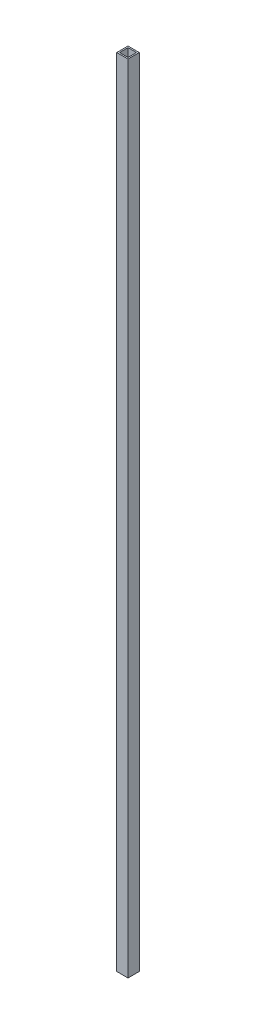
ISO-10303-21;
HEADER;
FILE_DESCRIPTION(('STEP AP214'),'2;1');
FILE_NAME('part.step','',(''),(''),'','','');
FILE_SCHEMA(('AUTOMOTIVE_DESIGN { 1 0 10303 214 1 1 1 1 }'));
ENDSEC;
DATA;
#1=APPLICATION_CONTEXT('core data for automotive mechanical design processes');
#2=APPLICATION_PROTOCOL_DEFINITION('international standard','automotive_design',2000,#1);
#3=PRODUCT_CONTEXT('',#1,'mechanical');
#4=PRODUCT('Part','Part','',(#3));
#5=PRODUCT_RELATED_PRODUCT_CATEGORY('part','',(#4));
#6=PRODUCT_DEFINITION_FORMATION('','',#4);
#7=PRODUCT_DEFINITION_CONTEXT('part definition',#1,'design');
#8=PRODUCT_DEFINITION('design','',#6,#7);
#9=PRODUCT_DEFINITION_SHAPE('','',#8);
#10=(LENGTH_UNIT() NAMED_UNIT(*) SI_UNIT(.MILLI.,.METRE.));
#11=(NAMED_UNIT(*) PLANE_ANGLE_UNIT() SI_UNIT($,.RADIAN.));
#12=(NAMED_UNIT(*) SI_UNIT($,.STERADIAN.) SOLID_ANGLE_UNIT());
#13=UNCERTAINTY_MEASURE_WITH_UNIT(LENGTH_MEASURE(1.E-05),#10,'distance_accuracy_value','');
#14=(GEOMETRIC_REPRESENTATION_CONTEXT(3) GLOBAL_UNCERTAINTY_ASSIGNED_CONTEXT((#13)) GLOBAL_UNIT_ASSIGNED_CONTEXT((#10,
#11,#12)) REPRESENTATION_CONTEXT('',''));
#15=CARTESIAN_POINT('',(0.,0.,0.));
#16=DIRECTION('',(0.,0.,1.));
#17=DIRECTION('',(1.,0.,0.));
#18=AXIS2_PLACEMENT_3D('',#15,#16,#17);
#19=CARTESIAN_POINT('',(0.,1408.5,0.));
#20=DIRECTION('',(0.,1.,0.));
#21=DIRECTION('',(0.,0.,1.));
#22=AXIS2_PLACEMENT_3D('',#19,#20,#21);
#23=PLANE('',#22);
#24=DIRECTION('',(0.,0.,1.));
#25=VECTOR('',#24,1.);
#26=CARTESIAN_POINT('',(-20.,1408.5,20.));
#27=LINE('',#26,#25);
#28=CARTESIAN_POINT('',(-20.,1408.5,-20.));
#29=VERTEX_POINT('',#28);
#30=CARTESIAN_POINT('',(-20.,1408.5,20.));
#31=VERTEX_POINT('',#30);
#32=EDGE_CURVE('E133',#29,#31,#27,.T.);
#33=ORIENTED_EDGE('',*,*,#32,.T.);
#34=DIRECTION('',(1.,0.,0.));
#35=VECTOR('',#34,1.);
#36=CARTESIAN_POINT('',(20.,1408.5,20.));
#37=LINE('',#36,#35);
#38=CARTESIAN_POINT('',(20.,1408.5,20.));
#39=VERTEX_POINT('',#38);
#40=EDGE_CURVE('E136',#31,#39,#37,.T.);
#41=ORIENTED_EDGE('',*,*,#40,.T.);
#42=DIRECTION('',(0.,0.,-1.));
#43=VECTOR('',#42,1.);
#44=CARTESIAN_POINT('',(20.,1408.5,20.));
#45=LINE('',#44,#43);
#46=CARTESIAN_POINT('',(20.,1408.5,-20.));
#47=VERTEX_POINT('',#46);
#48=EDGE_CURVE('E139',#39,#47,#45,.T.);
#49=ORIENTED_EDGE('',*,*,#48,.T.);
#50=DIRECTION('',(-1.,0.,0.));
#51=VECTOR('',#50,1.);
#52=CARTESIAN_POINT('',(20.,1408.5,-20.));
#53=LINE('',#52,#51);
#54=EDGE_CURVE('E141',#47,#29,#53,.T.);
#55=ORIENTED_EDGE('',*,*,#54,.T.);
#56=EDGE_LOOP('',(#33,#41,#49,#55));
#57=FACE_BOUND('',#56,.T.);
#58=DIRECTION('',(-1.,0.,0.));
#59=VECTOR('',#58,1.);
#60=CARTESIAN_POINT('',(15.,1408.5,-15.));
#61=LINE('',#60,#59);
#62=CARTESIAN_POINT('',(15.,1408.5,-15.));
#63=VERTEX_POINT('',#62);
#64=CARTESIAN_POINT('',(-15.,1408.5,-15.));
#65=VERTEX_POINT('',#64);
#66=EDGE_CURVE('E105',#63,#65,#61,.T.);
#67=ORIENTED_EDGE('',*,*,#66,.F.);
#68=DIRECTION('',(0.,0.,-1.));
#69=VECTOR('',#68,1.);
#70=CARTESIAN_POINT('',(15.,1408.5,15.));
#71=LINE('',#70,#69);
#72=CARTESIAN_POINT('',(15.,1408.5,15.));
#73=VERTEX_POINT('',#72);
#74=EDGE_CURVE('E97',#73,#63,#71,.T.);
#75=ORIENTED_EDGE('',*,*,#74,.F.);
#76=DIRECTION('',(1.,0.,0.));
#77=VECTOR('',#76,1.);
#78=CARTESIAN_POINT('',(15.,1408.5,15.));
#79=LINE('',#78,#77);
#80=CARTESIAN_POINT('',(-15.,1408.5,15.));
#81=VERTEX_POINT('',#80);
#82=EDGE_CURVE('E119',#81,#73,#79,.T.);
#83=ORIENTED_EDGE('',*,*,#82,.F.);
#84=DIRECTION('',(0.,0.,1.));
#85=VECTOR('',#84,1.);
#86=CARTESIAN_POINT('',(-15.,1408.5,15.));
#87=LINE('',#86,#85);
#88=EDGE_CURVE('E117',#65,#81,#87,.T.);
#89=ORIENTED_EDGE('',*,*,#88,.F.);
#90=EDGE_LOOP('',(#67,#75,#83,#89));
#91=FACE_BOUND('',#90,.T.);
#92=ADVANCED_FACE('F32',(#57,#91),#23,.T.);
#93=CARTESIAN_POINT('',(0.,-1408.5,0.));
#94=DIRECTION('',(0.,1.,0.));
#95=DIRECTION('',(0.,0.,1.));
#96=AXIS2_PLACEMENT_3D('',#93,#94,#95);
#97=PLANE('',#96);
#98=DIRECTION('',(0.,0.,1.));
#99=VECTOR('',#98,1.);
#100=CARTESIAN_POINT('',(-20.,-1408.5,20.));
#101=LINE('',#100,#99);
#102=CARTESIAN_POINT('',(-20.,-1408.5,-20.));
#103=VERTEX_POINT('',#102);
#104=CARTESIAN_POINT('',(-20.,-1408.5,20.));
#105=VERTEX_POINT('',#104);
#106=EDGE_CURVE('E113',#103,#105,#101,.T.);
#107=ORIENTED_EDGE('',*,*,#106,.F.);
#108=DIRECTION('',(-1.,0.,0.));
#109=VECTOR('',#108,1.);
#110=CARTESIAN_POINT('',(20.,-1408.5,-20.));
#111=LINE('',#110,#109);
#112=CARTESIAN_POINT('',(20.,-1408.5,-20.));
#113=VERTEX_POINT('',#112);
#114=EDGE_CURVE('E137',#113,#103,#111,.T.);
#115=ORIENTED_EDGE('',*,*,#114,.F.);
#116=DIRECTION('',(0.,0.,-1.));
#117=VECTOR('',#116,1.);
#118=CARTESIAN_POINT('',(20.,-1408.5,20.));
#119=LINE('',#118,#117);
#120=CARTESIAN_POINT('',(20.,-1408.5,20.));
#121=VERTEX_POINT('',#120);
#122=EDGE_CURVE('E148',#121,#113,#119,.T.);
#123=ORIENTED_EDGE('',*,*,#122,.F.);
#124=DIRECTION('',(1.,0.,0.));
#125=VECTOR('',#124,1.);
#126=CARTESIAN_POINT('',(20.,-1408.5,20.));
#127=LINE('',#126,#125);
#128=EDGE_CURVE('E146',#105,#121,#127,.T.);
#129=ORIENTED_EDGE('',*,*,#128,.F.);
#130=EDGE_LOOP('',(#107,#115,#123,#129));
#131=FACE_BOUND('',#130,.T.);
#132=DIRECTION('',(0.,0.,-1.));
#133=VECTOR('',#132,1.);
#134=CARTESIAN_POINT('',(15.,-1408.5,15.));
#135=LINE('',#134,#133);
#136=CARTESIAN_POINT('',(15.,-1408.5,15.));
#137=VERTEX_POINT('',#136);
#138=CARTESIAN_POINT('',(15.,-1408.5,-15.));
#139=VERTEX_POINT('',#138);
#140=EDGE_CURVE('E55',#137,#139,#135,.T.);
#141=ORIENTED_EDGE('',*,*,#140,.T.);
#142=DIRECTION('',(-1.,0.,0.));
#143=VECTOR('',#142,1.);
#144=CARTESIAN_POINT('',(15.,-1408.5,-15.));
#145=LINE('',#144,#143);
#146=CARTESIAN_POINT('',(-15.,-1408.5,-15.));
#147=VERTEX_POINT('',#146);
#148=EDGE_CURVE('E112',#139,#147,#145,.T.);
#149=ORIENTED_EDGE('',*,*,#148,.T.);
#150=DIRECTION('',(0.,0.,1.));
#151=VECTOR('',#150,1.);
#152=CARTESIAN_POINT('',(-15.,-1408.5,15.));
#153=LINE('',#152,#151);
#154=CARTESIAN_POINT('',(-15.,-1408.5,15.));
#155=VERTEX_POINT('',#154);
#156=EDGE_CURVE('E125',#147,#155,#153,.T.);
#157=ORIENTED_EDGE('',*,*,#156,.T.);
#158=DIRECTION('',(1.,0.,0.));
#159=VECTOR('',#158,1.);
#160=CARTESIAN_POINT('',(15.,-1408.5,15.));
#161=LINE('',#160,#159);
#162=EDGE_CURVE('E106',#155,#137,#161,.T.);
#163=ORIENTED_EDGE('',*,*,#162,.T.);
#164=EDGE_LOOP('',(#141,#149,#157,#163));
#165=FACE_BOUND('',#164,.T.);
#166=ADVANCED_FACE('F166',(#131,#165),#97,.F.);
#167=CARTESIAN_POINT('',(-20.,1408.5,20.));
#168=DIRECTION('',(1.,0.,0.));
#169=DIRECTION('',(0.,0.,-1.));
#170=AXIS2_PLACEMENT_3D('',#167,#168,#169);
#171=PLANE('',#170);
#172=ORIENTED_EDGE('',*,*,#106,.T.);
#173=DIRECTION('',(0.,-1.,0.));
#174=VECTOR('',#173,1.);
#175=CARTESIAN_POINT('',(-20.,1408.5,20.));
#176=LINE('',#175,#174);
#177=EDGE_CURVE('E11',#31,#105,#176,.T.);
#178=ORIENTED_EDGE('',*,*,#177,.F.);
#179=ORIENTED_EDGE('',*,*,#32,.F.);
#180=DIRECTION('',(0.,-1.,0.));
#181=VECTOR('',#180,1.);
#182=CARTESIAN_POINT('',(-20.,1408.5,-20.));
#183=LINE('',#182,#181);
#184=EDGE_CURVE('E143',#29,#103,#183,.T.);
#185=ORIENTED_EDGE('',*,*,#184,.T.);
#186=EDGE_LOOP('',(#172,#178,#179,#185));
#187=FACE_BOUND('',#186,.T.);
#188=ADVANCED_FACE('F34',(#187),#171,.F.);
#189=CARTESIAN_POINT('',(20.,1408.5,20.));
#190=DIRECTION('',(0.,0.,-1.));
#191=DIRECTION('',(-1.,0.,0.));
#192=AXIS2_PLACEMENT_3D('',#189,#190,#191);
#193=PLANE('',#192);
#194=ORIENTED_EDGE('',*,*,#128,.T.);
#195=DIRECTION('',(0.,-1.,0.));
#196=VECTOR('',#195,1.);
#197=CARTESIAN_POINT('',(20.,1408.5,20.));
#198=LINE('',#197,#196);
#199=EDGE_CURVE('E40',#39,#121,#198,.T.);
#200=ORIENTED_EDGE('',*,*,#199,.F.);
#201=ORIENTED_EDGE('',*,*,#40,.F.);
#202=ORIENTED_EDGE('',*,*,#177,.T.);
#203=EDGE_LOOP('',(#194,#200,#201,#202));
#204=FACE_BOUND('',#203,.T.);
#205=ADVANCED_FACE('F176',(#204),#193,.F.);
#206=CARTESIAN_POINT('',(20.,1408.5,20.));
#207=DIRECTION('',(-1.,0.,0.));
#208=DIRECTION('',(0.,0.,1.));
#209=AXIS2_PLACEMENT_3D('',#206,#207,#208);
#210=PLANE('',#209);
#211=ORIENTED_EDGE('',*,*,#122,.T.);
#212=DIRECTION('',(0.,-1.,0.));
#213=VECTOR('',#212,1.);
#214=CARTESIAN_POINT('',(20.,1408.5,-20.));
#215=LINE('',#214,#213);
#216=EDGE_CURVE('E153',#47,#113,#215,.T.);
#217=ORIENTED_EDGE('',*,*,#216,.F.);
#218=ORIENTED_EDGE('',*,*,#48,.F.);
#219=ORIENTED_EDGE('',*,*,#199,.T.);
#220=EDGE_LOOP('',(#211,#217,#218,#219));
#221=FACE_BOUND('',#220,.T.);
#222=ADVANCED_FACE('F160',(#221),#210,.F.);
#223=CARTESIAN_POINT('',(20.,1408.5,-20.));
#224=DIRECTION('',(0.,0.,1.));
#225=DIRECTION('',(1.,0.,0.));
#226=AXIS2_PLACEMENT_3D('',#223,#224,#225);
#227=PLANE('',#226);
#228=ORIENTED_EDGE('',*,*,#114,.T.);
#229=ORIENTED_EDGE('',*,*,#184,.F.);
#230=ORIENTED_EDGE('',*,*,#54,.F.);
#231=ORIENTED_EDGE('',*,*,#216,.T.);
#232=EDGE_LOOP('',(#228,#229,#230,#231));
#233=FACE_BOUND('',#232,.T.);
#234=ADVANCED_FACE('F170',(#233),#227,.F.);
#235=CARTESIAN_POINT('',(15.,1408.5,15.));
#236=DIRECTION('',(-1.,0.,0.));
#237=DIRECTION('',(0.,0.,1.));
#238=AXIS2_PLACEMENT_3D('',#235,#236,#237);
#239=PLANE('',#238);
#240=ORIENTED_EDGE('',*,*,#140,.F.);
#241=DIRECTION('',(0.,-1.,0.));
#242=VECTOR('',#241,1.);
#243=CARTESIAN_POINT('',(15.,1408.5,15.));
#244=LINE('',#243,#242);
#245=EDGE_CURVE('E101',#73,#137,#244,.T.);
#246=ORIENTED_EDGE('',*,*,#245,.F.);
#247=ORIENTED_EDGE('',*,*,#74,.T.);
#248=DIRECTION('',(0.,-1.,0.));
#249=VECTOR('',#248,1.);
#250=CARTESIAN_POINT('',(15.,1408.5,-15.));
#251=LINE('',#250,#249);
#252=EDGE_CURVE('E100',#63,#139,#251,.T.);
#253=ORIENTED_EDGE('',*,*,#252,.T.);
#254=EDGE_LOOP('',(#240,#246,#247,#253));
#255=FACE_BOUND('',#254,.T.);
#256=ADVANCED_FACE('F99',(#255),#239,.T.);
#257=CARTESIAN_POINT('',(15.,1408.5,-15.));
#258=DIRECTION('',(0.,0.,1.));
#259=DIRECTION('',(1.,0.,0.));
#260=AXIS2_PLACEMENT_3D('',#257,#258,#259);
#261=PLANE('',#260);
#262=ORIENTED_EDGE('',*,*,#148,.F.);
#263=ORIENTED_EDGE('',*,*,#252,.F.);
#264=ORIENTED_EDGE('',*,*,#66,.T.);
#265=DIRECTION('',(0.,-1.,0.));
#266=VECTOR('',#265,1.);
#267=CARTESIAN_POINT('',(-15.,1408.5,-15.));
#268=LINE('',#267,#266);
#269=EDGE_CURVE('E114',#65,#147,#268,.T.);
#270=ORIENTED_EDGE('',*,*,#269,.T.);
#271=EDGE_LOOP('',(#262,#263,#264,#270));
#272=FACE_BOUND('',#271,.T.);
#273=ADVANCED_FACE('F109',(#272),#261,.T.);
#274=CARTESIAN_POINT('',(-15.,1408.5,15.));
#275=DIRECTION('',(1.,0.,0.));
#276=DIRECTION('',(0.,0.,-1.));
#277=AXIS2_PLACEMENT_3D('',#274,#275,#276);
#278=PLANE('',#277);
#279=ORIENTED_EDGE('',*,*,#156,.F.);
#280=ORIENTED_EDGE('',*,*,#269,.F.);
#281=ORIENTED_EDGE('',*,*,#88,.T.);
#282=DIRECTION('',(0.,-1.,0.));
#283=VECTOR('',#282,1.);
#284=CARTESIAN_POINT('',(-15.,1408.5,15.));
#285=LINE('',#284,#283);
#286=EDGE_CURVE('E47',#81,#155,#285,.T.);
#287=ORIENTED_EDGE('',*,*,#286,.T.);
#288=EDGE_LOOP('',(#279,#280,#281,#287));
#289=FACE_BOUND('',#288,.T.);
#290=ADVANCED_FACE('F199',(#289),#278,.T.);
#291=CARTESIAN_POINT('',(15.,1408.5,15.));
#292=DIRECTION('',(0.,0.,-1.));
#293=DIRECTION('',(-1.,0.,0.));
#294=AXIS2_PLACEMENT_3D('',#291,#292,#293);
#295=PLANE('',#294);
#296=ORIENTED_EDGE('',*,*,#162,.F.);
#297=ORIENTED_EDGE('',*,*,#286,.F.);
#298=ORIENTED_EDGE('',*,*,#82,.T.);
#299=ORIENTED_EDGE('',*,*,#245,.T.);
#300=EDGE_LOOP('',(#296,#297,#298,#299));
#301=FACE_BOUND('',#300,.T.);
#302=ADVANCED_FACE('F203',(#301),#295,.T.);
#303=CLOSED_SHELL('',(#92,#166,#188,#205,#222,#234,#256,#273,#290,#302));
#304=MANIFOLD_SOLID_BREP('B2',#303);
#305=ADVANCED_BREP_SHAPE_REPRESENTATION('',(#18,#304),#14);
#306=SHAPE_DEFINITION_REPRESENTATION(#9,#305);
ENDSEC;
END-ISO-10303-21;
